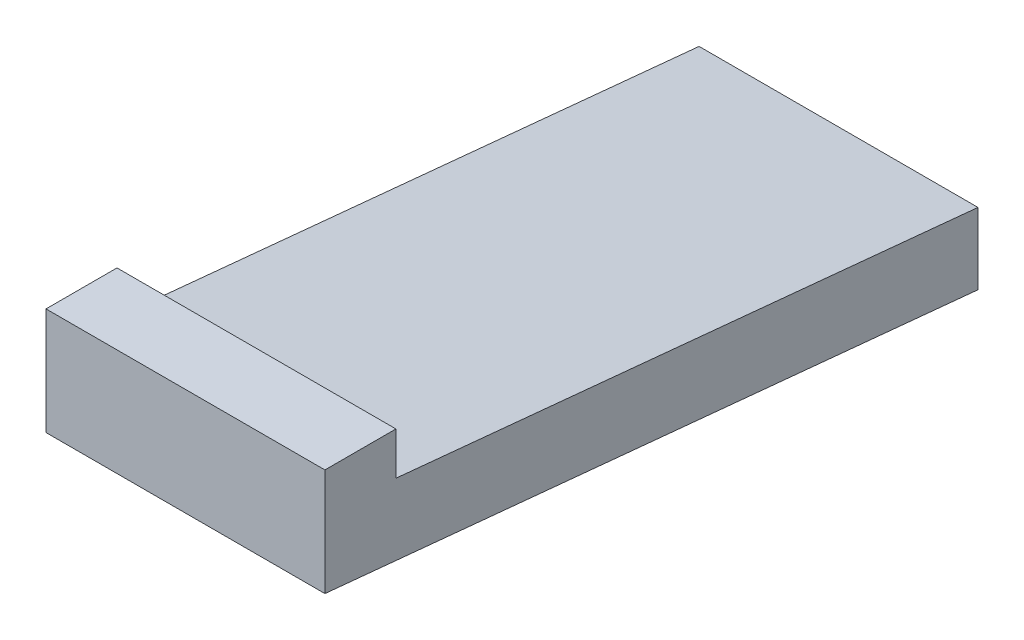
ISO-10303-21;
HEADER;
FILE_DESCRIPTION(('STEP AP214'),'2;1');
FILE_NAME('part.step','',(''),(''),'','','');
FILE_SCHEMA(('AUTOMOTIVE_DESIGN { 1 0 10303 214 1 1 1 1 }'));
ENDSEC;
DATA;
#1=APPLICATION_CONTEXT('core data for automotive mechanical design processes');
#2=APPLICATION_PROTOCOL_DEFINITION('international standard','automotive_design',2000,#1);
#3=PRODUCT_CONTEXT('',#1,'mechanical');
#4=PRODUCT('Part','Part','',(#3));
#5=PRODUCT_RELATED_PRODUCT_CATEGORY('part','',(#4));
#6=PRODUCT_DEFINITION_FORMATION('','',#4);
#7=PRODUCT_DEFINITION_CONTEXT('part definition',#1,'design');
#8=PRODUCT_DEFINITION('design','',#6,#7);
#9=PRODUCT_DEFINITION_SHAPE('','',#8);
#10=(LENGTH_UNIT() NAMED_UNIT(*) SI_UNIT(.MILLI.,.METRE.));
#11=(NAMED_UNIT(*) PLANE_ANGLE_UNIT() SI_UNIT($,.RADIAN.));
#12=(NAMED_UNIT(*) SI_UNIT($,.STERADIAN.) SOLID_ANGLE_UNIT());
#13=UNCERTAINTY_MEASURE_WITH_UNIT(LENGTH_MEASURE(1.E-05),#10,'distance_accuracy_value','');
#14=(GEOMETRIC_REPRESENTATION_CONTEXT(3) GLOBAL_UNCERTAINTY_ASSIGNED_CONTEXT((#13)) GLOBAL_UNIT_ASSIGNED_CONTEXT((#10,
#11,#12)) REPRESENTATION_CONTEXT('',''));
#15=CARTESIAN_POINT('',(0.,0.,0.));
#16=DIRECTION('',(0.,0.,1.));
#17=DIRECTION('',(1.,0.,0.));
#18=AXIS2_PLACEMENT_3D('',#15,#16,#17);
#19=CARTESIAN_POINT('',(2.11057050786774,-32.7210032360409,-20.6164214772802));
#20=DIRECTION('',(1.,0.,0.));
#21=DIRECTION('',(0.,1.,0.));
#22=AXIS2_PLACEMENT_3D('',#19,#20,#21);
#23=PLANE('',#22);
#24=CARTESIAN_POINT('',(2.11057050786774,-32.1242459344271,-15.4414214772803));
#25=CARTESIAN_POINT('',(2.11057050786774,-32.5708605386469,-20.0414214772802));
#26=(BOUNDED_CURVE() B_SPLINE_CURVE(1,(#24,#25),.UNSPECIFIED.,.F.,
.F.) B_SPLINE_CURVE_WITH_KNOTS((2,2),(0.,1.),
.UNSPECIFIED.) CURVE() GEOMETRIC_REPRESENTATION_ITEM() RATIONAL_B_SPLINE_CURVE((1.,1.)) REPRESENTATION_ITEM(''));
#27=CARTESIAN_POINT('',(2.11057050786774,-32.1242459344271,-15.4414214772803));
#28=VERTEX_POINT('',#27);
#29=CARTESIAN_POINT('',(2.11057050786774,-32.5708605386469,-20.0414214772802));
#30=VERTEX_POINT('',#29);
#31=EDGE_CURVE('E115',#28,#30,#26,.T.);
#32=ORIENTED_EDGE('',*,*,#31,.T.);
#33=CARTESIAN_POINT('',(2.11057050786774,-32.5708605386469,-20.0414214772802));
#34=CARTESIAN_POINT('',(2.11057050786774,-32.0685094428967,-20.0414214772802));
#35=(BOUNDED_CURVE() B_SPLINE_CURVE(1,(#33,#34),.UNSPECIFIED.,.F.,
.F.) B_SPLINE_CURVE_WITH_KNOTS((2,2),(1.,2.),
.UNSPECIFIED.) CURVE() GEOMETRIC_REPRESENTATION_ITEM() RATIONAL_B_SPLINE_CURVE((1.,1.)) REPRESENTATION_ITEM(''));
#36=CARTESIAN_POINT('',(2.11057050786774,-32.0685094428967,-20.0414214772802));
#37=VERTEX_POINT('',#36);
#38=EDGE_CURVE('E66',#30,#37,#35,.T.);
#39=ORIENTED_EDGE('',*,*,#38,.T.);
#40=CARTESIAN_POINT('',(2.11057050786774,-32.0685094428967,-20.0414214772802));
#41=CARTESIAN_POINT('',(2.11057050786774,-31.6704399043528,-15.9414214772803));
#42=(BOUNDED_CURVE() B_SPLINE_CURVE(1,(#40,#41),.UNSPECIFIED.,.F.,
.F.) B_SPLINE_CURVE_WITH_KNOTS((2,2),(2.,3.),
.UNSPECIFIED.) CURVE() GEOMETRIC_REPRESENTATION_ITEM() RATIONAL_B_SPLINE_CURVE((1.,1.)) REPRESENTATION_ITEM(''));
#43=CARTESIAN_POINT('',(2.11057050786774,-31.6704399043528,-15.9414214772803));
#44=VERTEX_POINT('',#43);
#45=EDGE_CURVE('E109',#37,#44,#42,.T.);
#46=ORIENTED_EDGE('',*,*,#45,.T.);
#47=CARTESIAN_POINT('',(2.11057050786774,-31.6704399043528,-15.9414214772803));
#48=CARTESIAN_POINT('',(2.11057050786774,-31.369718959495,-15.9414214772803));
#49=(BOUNDED_CURVE() B_SPLINE_CURVE(1,(#47,#48),.UNSPECIFIED.,.F.,
.F.) B_SPLINE_CURVE_WITH_KNOTS((2,2),(3.,4.),
.UNSPECIFIED.) CURVE() GEOMETRIC_REPRESENTATION_ITEM() RATIONAL_B_SPLINE_CURVE((1.,1.)) REPRESENTATION_ITEM(''));
#50=CARTESIAN_POINT('',(2.11057050786774,-31.369718959495,-15.9414214772803));
#51=VERTEX_POINT('',#50);
#52=EDGE_CURVE('E92',#44,#51,#49,.T.);
#53=ORIENTED_EDGE('',*,*,#52,.T.);
#54=CARTESIAN_POINT('',(2.11057050786774,-31.369718959495,-15.9414214772803));
#55=CARTESIAN_POINT('',(2.11057050786774,-31.369718959495,-15.4414214772803));
#56=(BOUNDED_CURVE() B_SPLINE_CURVE(1,(#54,#55),.UNSPECIFIED.,.F.,
.F.) B_SPLINE_CURVE_WITH_KNOTS((2,2),(4.,5.),
.UNSPECIFIED.) CURVE() GEOMETRIC_REPRESENTATION_ITEM() RATIONAL_B_SPLINE_CURVE((1.,1.)) REPRESENTATION_ITEM(''));
#57=CARTESIAN_POINT('',(2.11057050786774,-31.369718959495,-15.4414214772803));
#58=VERTEX_POINT('',#57);
#59=EDGE_CURVE('E135',#51,#58,#56,.T.);
#60=ORIENTED_EDGE('',*,*,#59,.T.);
#61=CARTESIAN_POINT('',(2.11057050786774,-31.369718959495,-15.4414214772803));
#62=CARTESIAN_POINT('',(2.11057050786774,-32.1242459344271,-15.4414214772803));
#63=(BOUNDED_CURVE() B_SPLINE_CURVE(1,(#61,#62),.UNSPECIFIED.,.F.,
.F.) B_SPLINE_CURVE_WITH_KNOTS((2,2),(5.,6.),
.UNSPECIFIED.) CURVE() GEOMETRIC_REPRESENTATION_ITEM() RATIONAL_B_SPLINE_CURVE((1.,1.)) REPRESENTATION_ITEM(''));
#64=EDGE_CURVE('E11',#58,#28,#63,.T.);
#65=ORIENTED_EDGE('',*,*,#64,.T.);
#66=EDGE_LOOP('',(#32,#39,#46,#53,#60,#65));
#67=FACE_BOUND('',#66,.T.);
#68=ADVANCED_FACE('F16',(#67),#23,.T.);
#69=CARTESIAN_POINT('',(0.146046976168087,-32.7210032360409,-20.6164214772802));
#70=DIRECTION('',(-1.,0.,0.));
#71=DIRECTION('',(0.,0.,1.));
#72=AXIS2_PLACEMENT_3D('',#69,#70,#71);
#73=PLANE('',#72);
#74=CARTESIAN_POINT('',(0.146046976168087,-31.369718959495,-15.4414214772803));
#75=CARTESIAN_POINT('',(0.146046976168087,-32.1242459344271,-15.4414214772803));
#76=(BOUNDED_CURVE() B_SPLINE_CURVE(1,(#74,#75),.UNSPECIFIED.,.F.,
.F.) B_SPLINE_CURVE_WITH_KNOTS((2,2),(5.,6.),
.UNSPECIFIED.) CURVE() GEOMETRIC_REPRESENTATION_ITEM() RATIONAL_B_SPLINE_CURVE((1.,1.)) REPRESENTATION_ITEM(''));
#77=CARTESIAN_POINT('',(0.146046976168087,-31.369718959495,-15.4414214772803));
#78=VERTEX_POINT('',#77);
#79=CARTESIAN_POINT('',(0.146046976168087,-32.1242459344271,-15.4414214772803));
#80=VERTEX_POINT('',#79);
#81=EDGE_CURVE('E29',#78,#80,#76,.T.);
#82=ORIENTED_EDGE('',*,*,#81,.F.);
#83=CARTESIAN_POINT('',(0.146046976168087,-31.369718959495,-15.9414214772803));
#84=CARTESIAN_POINT('',(0.146046976168087,-31.369718959495,-15.4414214772803));
#85=(BOUNDED_CURVE() B_SPLINE_CURVE(1,(#83,#84),.UNSPECIFIED.,.F.,
.F.) B_SPLINE_CURVE_WITH_KNOTS((2,2),(4.,5.),
.UNSPECIFIED.) CURVE() GEOMETRIC_REPRESENTATION_ITEM() RATIONAL_B_SPLINE_CURVE((1.,1.)) REPRESENTATION_ITEM(''));
#86=CARTESIAN_POINT('',(0.146046976168087,-31.369718959495,-15.9414214772803));
#87=VERTEX_POINT('',#86);
#88=EDGE_CURVE('E132',#87,#78,#85,.T.);
#89=ORIENTED_EDGE('',*,*,#88,.F.);
#90=CARTESIAN_POINT('',(0.146046976168087,-31.6704399043528,-15.9414214772803));
#91=CARTESIAN_POINT('',(0.146046976168087,-31.369718959495,-15.9414214772803));
#92=(BOUNDED_CURVE() B_SPLINE_CURVE(1,(#90,#91),.UNSPECIFIED.,.F.,
.F.) B_SPLINE_CURVE_WITH_KNOTS((2,2),(3.,4.),
.UNSPECIFIED.) CURVE() GEOMETRIC_REPRESENTATION_ITEM() RATIONAL_B_SPLINE_CURVE((1.,1.)) REPRESENTATION_ITEM(''));
#93=CARTESIAN_POINT('',(0.146046976168087,-31.6704399043528,-15.9414214772803));
#94=VERTEX_POINT('',#93);
#95=EDGE_CURVE('E102',#94,#87,#92,.T.);
#96=ORIENTED_EDGE('',*,*,#95,.F.);
#97=CARTESIAN_POINT('',(0.146046976168087,-32.0685094428967,-20.0414214772802));
#98=CARTESIAN_POINT('',(0.146046976168087,-31.6704399043528,-15.9414214772803));
#99=(BOUNDED_CURVE() B_SPLINE_CURVE(1,(#97,#98),.UNSPECIFIED.,.F.,
.F.) B_SPLINE_CURVE_WITH_KNOTS((2,2),(2.,3.),
.UNSPECIFIED.) CURVE() GEOMETRIC_REPRESENTATION_ITEM() RATIONAL_B_SPLINE_CURVE((1.,1.)) REPRESENTATION_ITEM(''));
#100=CARTESIAN_POINT('',(0.146046976168087,-32.0685094428967,-20.0414214772802));
#101=VERTEX_POINT('',#100);
#102=EDGE_CURVE('E20',#101,#94,#99,.T.);
#103=ORIENTED_EDGE('',*,*,#102,.F.);
#104=CARTESIAN_POINT('',(0.146046976168087,-32.5708605386469,-20.0414214772802));
#105=CARTESIAN_POINT('',(0.146046976168087,-32.0685094428967,-20.0414214772802));
#106=(BOUNDED_CURVE() B_SPLINE_CURVE(1,(#104,#105),.UNSPECIFIED.,.F.,
.F.) B_SPLINE_CURVE_WITH_KNOTS((2,2),(1.,2.),
.UNSPECIFIED.) CURVE() GEOMETRIC_REPRESENTATION_ITEM() RATIONAL_B_SPLINE_CURVE((1.,1.)) REPRESENTATION_ITEM(''));
#107=CARTESIAN_POINT('',(0.146046976168087,-32.5708605386469,-20.0414214772802));
#108=VERTEX_POINT('',#107);
#109=EDGE_CURVE('E77',#108,#101,#106,.T.);
#110=ORIENTED_EDGE('',*,*,#109,.F.);
#111=CARTESIAN_POINT('',(0.146046976168087,-32.1242459344271,-15.4414214772803));
#112=CARTESIAN_POINT('',(0.146046976168087,-32.5708605386469,-20.0414214772802));
#113=(BOUNDED_CURVE() B_SPLINE_CURVE(1,(#111,#112),.UNSPECIFIED.,.F.,
.F.) B_SPLINE_CURVE_WITH_KNOTS((2,2),(0.,1.),
.UNSPECIFIED.) CURVE() GEOMETRIC_REPRESENTATION_ITEM() RATIONAL_B_SPLINE_CURVE((1.,1.)) REPRESENTATION_ITEM(''));
#114=EDGE_CURVE('E165',#80,#108,#113,.T.);
#115=ORIENTED_EDGE('',*,*,#114,.F.);
#116=EDGE_LOOP('',(#82,#89,#96,#103,#110,#115));
#117=FACE_BOUND('',#116,.T.);
#118=ADVANCED_FACE('F243',(#117),#73,.T.);
#119=CARTESIAN_POINT('',(0.146046976168087,-31.369718959495,-15.4414214772803));
#120=DIRECTION('',(0.,0.,1.));
#121=DIRECTION('',(1.,0.,0.));
#122=AXIS2_PLACEMENT_3D('',#119,#120,#121);
#123=PLANE('',#122);
#124=ORIENTED_EDGE('',*,*,#81,.T.);
#125=CARTESIAN_POINT('',(0.146046976168087,-32.1242459344271,-15.4414214772803));
#126=CARTESIAN_POINT('',(2.11057050786774,-32.1242459344271,-15.4414214772803));
#127=(BOUNDED_CURVE() B_SPLINE_CURVE(1,(#125,#126),.UNSPECIFIED.,.F.,
.F.) B_SPLINE_CURVE_WITH_KNOTS((2,2),(0.,1.96452353169965),
.UNSPECIFIED.) CURVE() GEOMETRIC_REPRESENTATION_ITEM() RATIONAL_B_SPLINE_CURVE((1.,1.)) REPRESENTATION_ITEM(''));
#128=EDGE_CURVE('E126',#80,#28,#127,.T.);
#129=ORIENTED_EDGE('',*,*,#128,.T.);
#130=ORIENTED_EDGE('',*,*,#64,.F.);
#131=CARTESIAN_POINT('',(0.146046976168087,-31.369718959495,-15.4414214772803));
#132=CARTESIAN_POINT('',(2.11057050786774,-31.369718959495,-15.4414214772803));
#133=(BOUNDED_CURVE() B_SPLINE_CURVE(1,(#131,#132),.UNSPECIFIED.,.F.,
.F.) B_SPLINE_CURVE_WITH_KNOTS((2,2),(0.,1.96452353169965),
.UNSPECIFIED.) CURVE() GEOMETRIC_REPRESENTATION_ITEM() RATIONAL_B_SPLINE_CURVE((1.,1.)) REPRESENTATION_ITEM(''));
#134=EDGE_CURVE('E142',#78,#58,#133,.T.);
#135=ORIENTED_EDGE('',*,*,#134,.F.);
#136=EDGE_LOOP('',(#124,#129,#130,#135));
#137=FACE_BOUND('',#136,.T.);
#138=ADVANCED_FACE('F248',(#137),#123,.T.);
#139=CARTESIAN_POINT('',(0.146046976168087,-31.369718959495,-15.9414214772803));
#140=DIRECTION('',(0.,1.,0.));
#141=DIRECTION('',(1.,0.,0.));
#142=AXIS2_PLACEMENT_3D('',#139,#140,#141);
#143=PLANE('',#142);
#144=ORIENTED_EDGE('',*,*,#88,.T.);
#145=ORIENTED_EDGE('',*,*,#134,.T.);
#146=ORIENTED_EDGE('',*,*,#59,.F.);
#147=CARTESIAN_POINT('',(0.146046976168087,-31.369718959495,-15.9414214772803));
#148=CARTESIAN_POINT('',(2.11057050786774,-31.369718959495,-15.9414214772803));
#149=(BOUNDED_CURVE() B_SPLINE_CURVE(1,(#147,#148),.UNSPECIFIED.,.F.,
.F.) B_SPLINE_CURVE_WITH_KNOTS((2,2),(0.,1.96452353169965),
.UNSPECIFIED.) CURVE() GEOMETRIC_REPRESENTATION_ITEM() RATIONAL_B_SPLINE_CURVE((1.,1.)) REPRESENTATION_ITEM(''));
#150=EDGE_CURVE('E179',#87,#51,#149,.T.);
#151=ORIENTED_EDGE('',*,*,#150,.F.);
#152=EDGE_LOOP('',(#144,#145,#146,#151));
#153=FACE_BOUND('',#152,.T.);
#154=ADVANCED_FACE('F275',(#153),#143,.T.);
#155=CARTESIAN_POINT('',(0.146046976168087,-31.6704399043528,-15.9414214772803));
#156=DIRECTION('',(0.,0.,-1.));
#157=DIRECTION('',(0.,-1.,0.));
#158=AXIS2_PLACEMENT_3D('',#155,#156,#157);
#159=PLANE('',#158);
#160=ORIENTED_EDGE('',*,*,#95,.T.);
#161=ORIENTED_EDGE('',*,*,#150,.T.);
#162=ORIENTED_EDGE('',*,*,#52,.F.);
#163=CARTESIAN_POINT('',(0.146046976168087,-31.6704399043528,-15.9414214772803));
#164=CARTESIAN_POINT('',(2.11057050786774,-31.6704399043528,-15.9414214772803));
#165=(BOUNDED_CURVE() B_SPLINE_CURVE(1,(#163,#164),.UNSPECIFIED.,.F.,
.F.) B_SPLINE_CURVE_WITH_KNOTS((2,2),(0.,1.96452353169965),
.UNSPECIFIED.) CURVE() GEOMETRIC_REPRESENTATION_ITEM() RATIONAL_B_SPLINE_CURVE((1.,1.)) REPRESENTATION_ITEM(''));
#166=EDGE_CURVE('E112',#94,#44,#165,.T.);
#167=ORIENTED_EDGE('',*,*,#166,.F.);
#168=EDGE_LOOP('',(#160,#161,#162,#167));
#169=FACE_BOUND('',#168,.T.);
#170=ADVANCED_FACE('F280',(#169),#159,.T.);
#171=CARTESIAN_POINT('',(0.146046976168087,-32.0685094428967,-20.0414214772802));
#172=DIRECTION('',(0.,0.995319815622664,-0.0966357316362143));
#173=DIRECTION('',(-1.,0.,0.));
#174=AXIS2_PLACEMENT_3D('',#171,#172,#173);
#175=PLANE('',#174);
#176=ORIENTED_EDGE('',*,*,#102,.T.);
#177=ORIENTED_EDGE('',*,*,#166,.T.);
#178=ORIENTED_EDGE('',*,*,#45,.F.);
#179=CARTESIAN_POINT('',(0.146046976168087,-32.0685094428967,-20.0414214772802));
#180=CARTESIAN_POINT('',(2.11057050786774,-32.0685094428967,-20.0414214772802));
#181=(BOUNDED_CURVE() B_SPLINE_CURVE(1,(#179,#180),.UNSPECIFIED.,.F.,
.F.) B_SPLINE_CURVE_WITH_KNOTS((2,2),(0.,1.96452353169965),
.UNSPECIFIED.) CURVE() GEOMETRIC_REPRESENTATION_ITEM() RATIONAL_B_SPLINE_CURVE((1.,1.)) REPRESENTATION_ITEM(''));
#182=EDGE_CURVE('E111',#101,#37,#181,.T.);
#183=ORIENTED_EDGE('',*,*,#182,.F.);
#184=EDGE_LOOP('',(#176,#177,#178,#183));
#185=FACE_BOUND('',#184,.T.);
#186=ADVANCED_FACE('F18',(#185),#175,.T.);
#187=CARTESIAN_POINT('',(0.146046976168087,-32.5708605386469,-20.0414214772802));
#188=DIRECTION('',(0.,0.,-1.));
#189=DIRECTION('',(0.,-1.,0.));
#190=AXIS2_PLACEMENT_3D('',#187,#188,#189);
#191=PLANE('',#190);
#192=ORIENTED_EDGE('',*,*,#109,.T.);
#193=ORIENTED_EDGE('',*,*,#182,.T.);
#194=ORIENTED_EDGE('',*,*,#38,.F.);
#195=CARTESIAN_POINT('',(0.146046976168087,-32.5708605386469,-20.0414214772802));
#196=CARTESIAN_POINT('',(2.11057050786774,-32.5708605386469,-20.0414214772802));
#197=(BOUNDED_CURVE() B_SPLINE_CURVE(1,(#195,#196),.UNSPECIFIED.,.F.,
.F.) B_SPLINE_CURVE_WITH_KNOTS((2,2),(0.,1.96452353169965),
.UNSPECIFIED.) CURVE() GEOMETRIC_REPRESENTATION_ITEM() RATIONAL_B_SPLINE_CURVE((1.,1.)) REPRESENTATION_ITEM(''));
#198=EDGE_CURVE('E158',#108,#30,#197,.T.);
#199=ORIENTED_EDGE('',*,*,#198,.F.);
#200=EDGE_LOOP('',(#192,#193,#194,#199));
#201=FACE_BOUND('',#200,.T.);
#202=ADVANCED_FACE('F119',(#201),#191,.T.);
#203=CARTESIAN_POINT('',(0.146046976168087,-32.1242459344271,-15.4414214772803));
#204=DIRECTION('',(0.,-0.995319815622666,0.0966357316361943));
#205=DIRECTION('',(-1.,0.,0.));
#206=AXIS2_PLACEMENT_3D('',#203,#204,#205);
#207=PLANE('',#206);
#208=ORIENTED_EDGE('',*,*,#114,.T.);
#209=ORIENTED_EDGE('',*,*,#198,.T.);
#210=ORIENTED_EDGE('',*,*,#31,.F.);
#211=ORIENTED_EDGE('',*,*,#128,.F.);
#212=EDGE_LOOP('',(#208,#209,#210,#211));
#213=FACE_BOUND('',#212,.T.);
#214=ADVANCED_FACE('F260',(#213),#207,.T.);
#215=CLOSED_SHELL('',(#68,#118,#138,#154,#170,#186,#202,#214));
#216=MANIFOLD_SOLID_BREP('B1',#215);
#217=ADVANCED_BREP_SHAPE_REPRESENTATION('',(#18,#216),#14);
#218=SHAPE_DEFINITION_REPRESENTATION(#9,#217);
ENDSEC;
END-ISO-10303-21;
